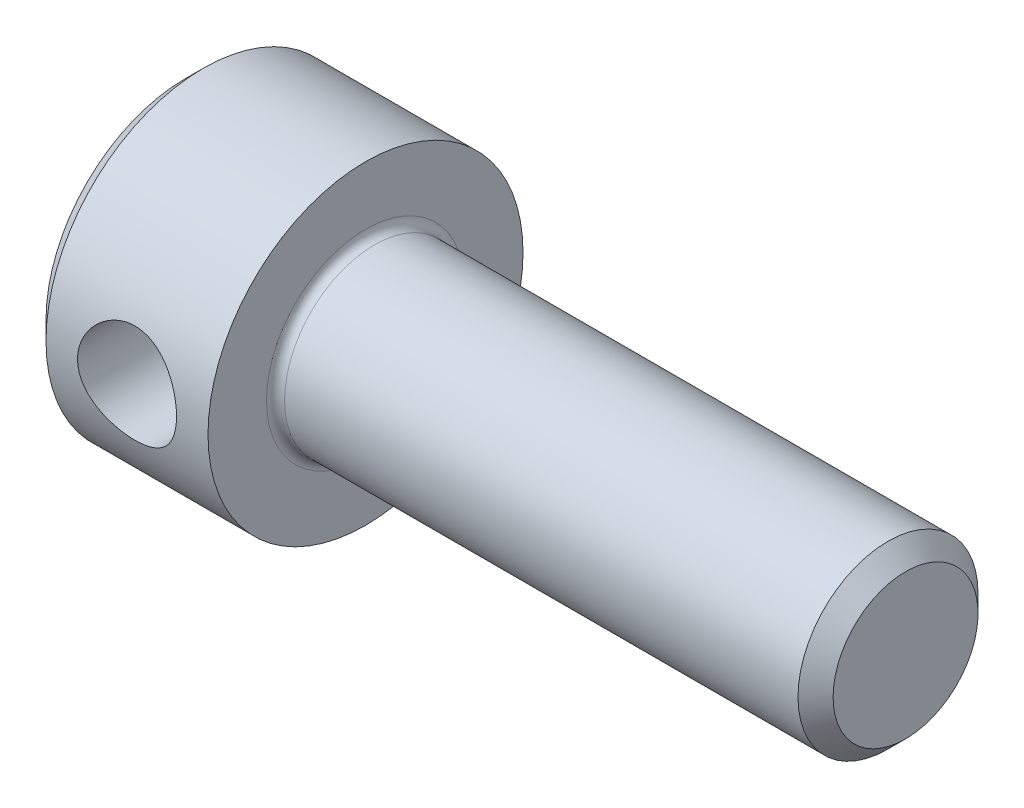
ISO-10303-21;
HEADER;
FILE_DESCRIPTION(('STEP AP214'),'2;1');
FILE_NAME('part.step','',(''),(''),'','','');
FILE_SCHEMA(('AUTOMOTIVE_DESIGN { 1 0 10303 214 1 1 1 1 }'));
ENDSEC;
DATA;
#1=APPLICATION_CONTEXT('core data for automotive mechanical design processes');
#2=APPLICATION_PROTOCOL_DEFINITION('international standard','automotive_design',2000,#1);
#3=PRODUCT_CONTEXT('',#1,'mechanical');
#4=PRODUCT('Part','Part','',(#3));
#5=PRODUCT_RELATED_PRODUCT_CATEGORY('part','',(#4));
#6=PRODUCT_DEFINITION_FORMATION('','',#4);
#7=PRODUCT_DEFINITION_CONTEXT('part definition',#1,'design');
#8=PRODUCT_DEFINITION('design','',#6,#7);
#9=PRODUCT_DEFINITION_SHAPE('','',#8);
#10=(LENGTH_UNIT() NAMED_UNIT(*) SI_UNIT(.MILLI.,.METRE.));
#11=(NAMED_UNIT(*) PLANE_ANGLE_UNIT() SI_UNIT($,.RADIAN.));
#12=(NAMED_UNIT(*) SI_UNIT($,.STERADIAN.) SOLID_ANGLE_UNIT());
#13=UNCERTAINTY_MEASURE_WITH_UNIT(LENGTH_MEASURE(1.E-05),#10,'distance_accuracy_value','');
#14=(GEOMETRIC_REPRESENTATION_CONTEXT(3) GLOBAL_UNCERTAINTY_ASSIGNED_CONTEXT((#13)) GLOBAL_UNIT_ASSIGNED_CONTEXT((#10,
#11,#12)) REPRESENTATION_CONTEXT('',''));
#15=CARTESIAN_POINT('',(0.,0.,0.));
#16=DIRECTION('',(0.,0.,1.));
#17=DIRECTION('',(1.,0.,0.));
#18=AXIS2_PLACEMENT_3D('',#15,#16,#17);
#19=CARTESIAN_POINT('',(-41.2573877243181,3.85092059838894,0.));
#20=DIRECTION('',(-1.,0.,0.));
#21=DIRECTION('',(0.,0.,1.));
#22=AXIS2_PLACEMENT_3D('',#19,#20,#21);
#23=CONICAL_SURFACE('',#22,1.5355,1.04719755119659);
#24=CARTESIAN_POINT('',(-41.2573877243181,3.85092059838894,0.));
#25=DIRECTION('',(-1.,0.,0.));
#26=DIRECTION('',(0.,0.,1.));
#27=AXIS2_PLACEMENT_3D('',#24,#25,#26);
#28=CIRCLE('',#27,1.5355);
#29=CARTESIAN_POINT('',(-41.2573877243181,2.52113859087794,0.767749999999976));
#30=VERTEX_POINT('',#29);
#31=CARTESIAN_POINT('',(-41.2573877243181,2.76925521574975,1.08984414023288));
#32=VERTEX_POINT('',#31);
#33=EDGE_CURVE('E162',#30,#32,#28,.T.);
#34=ORIENTED_EDGE('',*,*,#33,.T.);
#35=CARTESIAN_POINT('',(-41.3462398581514,2.78952319647957,1.31434233968245));
#36=CARTESIAN_POINT('',(-41.3296579013638,2.78500952857554,1.27377310679375));
#37=CARTESIAN_POINT('',(-41.3132698789426,2.78096848502642,1.23307458104));
#38=CARTESIAN_POINT('',(-41.281007371459,2.77376348555513,1.15139288716808));
#39=CARTESIAN_POINT('',(-41.265132935054,2.77059961252299,1.1104096925244));
#40=CARTESIAN_POINT('',(-41.2183409265454,2.76229915882602,0.986655695757561));
#41=CARTESIAN_POINT('',(-41.188397884933,2.75839101181697,0.903425163963204));
#42=CARTESIAN_POINT('',(-41.1330773304311,2.75318184444412,0.736539372571515));
#43=CARTESIAN_POINT('',(-41.1076465760028,2.75184828535579,0.652902990600578));
#44=CARTESIAN_POINT('',(-41.0634486065729,2.75071392124133,0.483935928030153));
#45=CARTESIAN_POINT('',(-41.0446701055224,2.75091050706179,0.398608378934132));
#46=CARTESIAN_POINT('',(-41.0205401880545,2.75148710934849,0.247656785120565));
#47=CARTESIAN_POINT('',(-41.0130140083932,2.75180955791364,0.182393152964781));
#48=CARTESIAN_POINT('',(-41.004817430063,2.7521686186372,0.0514477776131256));
#49=CARTESIAN_POINT('',(-41.0041430009028,2.7522053988349,-0.0142336970320513));
#50=CARTESIAN_POINT('',(-41.0097649572203,2.75194934321751,-0.145338797476179));
#51=CARTESIAN_POINT('',(-41.0160676906348,2.75165620723522,-0.210762134028722));
#52=CARTESIAN_POINT('',(-41.0346204106051,2.75111864096559,-0.340780601849683));
#53=CARTESIAN_POINT('',(-41.0468759370648,2.75087425634765,-0.405374903996106));
#54=CARTESIAN_POINT('',(-41.0777998334165,2.7509885100608,-0.542124262995785));
#55=CARTESIAN_POINT('',(-41.0971082022216,2.75143249953147,-0.614130299356506));
#56=CARTESIAN_POINT('',(-41.1396123725768,2.75379098210048,-0.756940889386141));
#57=CARTESIAN_POINT('',(-41.1628086325118,2.75570564868811,-0.827745300297328));
#58=CARTESIAN_POINT('',(-41.211768695407,2.76152963754729,-0.968373032486061));
#59=CARTESIAN_POINT('',(-41.2375326452337,2.76543907396831,-1.03819629738315));
#60=CARTESIAN_POINT('',(-41.2907873661122,2.77561965734353,-1.17691119919907));
#61=CARTESIAN_POINT('',(-41.3182760079251,2.7818879381685,-1.24580386203931));
#62=CARTESIAN_POINT('',(-41.3462398581525,2.78952319647878,-1.31434233968435));
#63=B_SPLINE_CURVE_WITH_KNOTS('',3,(#35,#36,#37,#38,#39,#40,#41,#42,#43,#44,#45,#46,#47,#48,#49,
#50,#51,#52,#53,#54,#55,#56,#57,#58,#59,#60,#61,#62),.UNSPECIFIED.,.F.,.F.,(4,2,2,2,2,2,2,2,2,2,
2,2,2,4),(0.,0.132169173373498,0.264350832089951,0.529838348402077,0.791947973616807,
1.05361075604424,1.25039394139162,1.44706136379172,1.64390786460278,1.84093791054354,
2.06441651424291,2.28792148477808,2.51143924668136,2.73468629421367),.UNSPECIFIED.);
#64=CARTESIAN_POINT('',(-41.2573877243181,2.76925521574975,-1.08984414023293));
#65=VERTEX_POINT('',#64);
#66=EDGE_CURVE('E11',#32,#65,#63,.T.);
#67=ORIENTED_EDGE('',*,*,#66,.T.);
#68=CARTESIAN_POINT('',(-41.2573877243181,2.52113859087793,-0.767750000000027));
#69=VERTEX_POINT('',#68);
#70=EDGE_CURVE('E152',#65,#69,#28,.T.);
#71=ORIENTED_EDGE('',*,*,#70,.T.);
#72=EDGE_CURVE('E154',#69,#30,#28,.T.);
#73=ORIENTED_EDGE('',*,*,#72,.T.);
#74=EDGE_LOOP('',(#34,#67,#71,#73));
#75=FACE_BOUND('',#74,.T.);
#76=ADVANCED_FACE('F39',(#75),#23,.F.);
#77=CARTESIAN_POINT('',(-43.2573877243181,3.85092059838894,0.));
#78=DIRECTION('',(-1.,0.,0.));
#79=DIRECTION('',(0.,0.,1.));
#80=AXIS2_PLACEMENT_3D('',#77,#78,#79);
#81=PLANE('',#80);
#82=DIRECTION('',(0.,-0.499999999999999,0.866025403784439));
#83=VECTOR('',#82,1.);
#84=CARTESIAN_POINT('',(-43.2573877243181,5.62396327507028,0.));
#85=LINE('',#84,#83);
#86=CARTESIAN_POINT('',(-43.2573877243181,5.62396327507028,0.));
#87=VERTEX_POINT('',#86);
#88=CARTESIAN_POINT('',(-43.2573877243181,4.73744193672961,1.53549999999997));
#89=VERTEX_POINT('',#88);
#90=EDGE_CURVE('E259',#87,#89,#85,.T.);
#91=ORIENTED_EDGE('',*,*,#90,.T.);
#92=DIRECTION('',(0.,1.,0.));
#93=VECTOR('',#92,1.);
#94=CARTESIAN_POINT('',(-43.2573877243181,2.96439926004827,1.53549999999997));
#95=LINE('',#94,#93);
#96=CARTESIAN_POINT('',(-43.2573877243181,2.96439926004827,1.53549999999997));
#97=VERTEX_POINT('',#96);
#98=EDGE_CURVE('E282',#97,#89,#95,.T.);
#99=ORIENTED_EDGE('',*,*,#98,.F.);
#100=DIRECTION('',(0.,-0.500000000000001,-0.866025403784438));
#101=VECTOR('',#100,1.);
#102=CARTESIAN_POINT('',(-43.2573877243181,2.96439926004827,1.53549999999997));
#103=LINE('',#102,#101);
#104=CARTESIAN_POINT('',(-43.2573877243181,2.0778779217076,0.));
#105=VERTEX_POINT('',#104);
#106=EDGE_CURVE('E286',#97,#105,#103,.T.);
#107=ORIENTED_EDGE('',*,*,#106,.T.);
#108=DIRECTION('',(0.,0.499999999999999,-0.866025403784439));
#109=VECTOR('',#108,1.);
#110=CARTESIAN_POINT('',(-43.2573877243181,2.0778779217076,0.));
#111=LINE('',#110,#109);
#112=CARTESIAN_POINT('',(-43.2573877243181,2.96439926004827,-1.53550000000003));
#113=VERTEX_POINT('',#112);
#114=EDGE_CURVE('E290',#105,#113,#111,.T.);
#115=ORIENTED_EDGE('',*,*,#114,.T.);
#116=DIRECTION('',(0.,-1.,0.));
#117=VECTOR('',#116,1.);
#118=CARTESIAN_POINT('',(-43.2573877243181,4.73744193672961,-1.53550000000003));
#119=LINE('',#118,#117);
#120=CARTESIAN_POINT('',(-43.2573877243181,4.73744193672961,-1.53550000000003));
#121=VERTEX_POINT('',#120);
#122=EDGE_CURVE('E294',#121,#113,#119,.T.);
#123=ORIENTED_EDGE('',*,*,#122,.F.);
#124=DIRECTION('',(0.,-0.500000000000001,-0.866025403784438));
#125=VECTOR('',#124,1.);
#126=CARTESIAN_POINT('',(-43.2573877243181,5.62396327507028,0.));
#127=LINE('',#126,#125);
#128=EDGE_CURVE('E298',#87,#121,#127,.T.);
#129=ORIENTED_EDGE('',*,*,#128,.F.);
#130=EDGE_LOOP('',(#91,#99,#107,#115,#123,#129));
#131=FACE_BOUND('',#130,.T.);
#132=CARTESIAN_POINT('',(-43.2573877243181,3.85092059838894,0.));
#133=DIRECTION('',(-1.,0.,0.));
#134=DIRECTION('',(0.,0.,1.));
#135=AXIS2_PLACEMENT_3D('',#132,#133,#134);
#136=CIRCLE('',#135,3.1);
#137=CARTESIAN_POINT('',(-43.2573877243181,3.85092059838894,3.09999999999997));
#138=VERTEX_POINT('',#137);
#139=EDGE_CURVE('E172',#138,#138,#136,.T.);
#140=ORIENTED_EDGE('',*,*,#139,.T.);
#141=EDGE_LOOP('',(#140));
#142=FACE_BOUND('',#141,.T.);
#143=ADVANCED_FACE('F327',(#131,#142),#81,.T.);
#144=CARTESIAN_POINT('',(-27.2573877243181,5.46092059838894,0.));
#145=DIRECTION('',(1.,0.,0.));
#146=DIRECTION('',(0.,0.,-1.));
#147=AXIS2_PLACEMENT_3D('',#144,#145,#146);
#148=PLANE('',#147);
#149=CARTESIAN_POINT('',(-27.2573877243181,3.85092059838894,0.));
#150=DIRECTION('',(-1.,0.,0.));
#151=DIRECTION('',(0.,0.,1.));
#152=AXIS2_PLACEMENT_3D('',#149,#150,#151);
#153=CIRCLE('',#152,1.61);
#154=CARTESIAN_POINT('',(-27.2573877243181,3.85092059838894,1.60999999999997));
#155=VERTEX_POINT('',#154);
#156=EDGE_CURVE('E190',#155,#155,#153,.T.);
#157=ORIENTED_EDGE('',*,*,#156,.F.);
#158=EDGE_LOOP('',(#157));
#159=FACE_BOUND('',#158,.T.);
#160=ADVANCED_FACE('F373',(#159),#148,.T.);
#161=CARTESIAN_POINT('',(-27.2573877243181,3.85092059838894,0.));
#162=DIRECTION('',(-1.,0.,0.));
#163=DIRECTION('',(0.,0.,1.));
#164=AXIS2_PLACEMENT_3D('',#161,#162,#163);
#165=CONICAL_SURFACE('',#164,1.61,0.785398163397465);
#166=CARTESIAN_POINT('',(-27.6473877243181,3.85092059838894,0.));
#167=DIRECTION('',(-1.,0.,0.));
#168=DIRECTION('',(0.,0.,1.));
#169=AXIS2_PLACEMENT_3D('',#166,#167,#168);
#170=CIRCLE('',#169,2.);
#171=CARTESIAN_POINT('',(-27.6473877243181,3.85092059838894,1.99999999999997));
#172=VERTEX_POINT('',#171);
#173=EDGE_CURVE('E186',#172,#172,#170,.T.);
#174=ORIENTED_EDGE('',*,*,#173,.F.);
#175=EDGE_LOOP('',(#174));
#176=FACE_BOUND('',#175,.T.);
#177=ORIENTED_EDGE('',*,*,#156,.T.);
#178=EDGE_LOOP('',(#177));
#179=FACE_BOUND('',#178,.T.);
#180=ADVANCED_FACE('F516',(#176,#179),#165,.T.);
#181=CARTESIAN_POINT('',(-75.0073877243181,3.85092059838894,0.));
#182=DIRECTION('',(-1.,0.,0.));
#183=DIRECTION('',(0.,0.,1.));
#184=AXIS2_PLACEMENT_3D('',#181,#182,#183);
#185=CYLINDRICAL_SURFACE('',#184,2.);
#186=CARTESIAN_POINT('',(-39.0573877243181,3.85092059838894,0.));
#187=DIRECTION('',(1.,0.,0.));
#188=DIRECTION('',(0.,0.,-1.));
#189=AXIS2_PLACEMENT_3D('',#186,#187,#188);
#190=CIRCLE('',#189,2.);
#191=CARTESIAN_POINT('',(-39.0573877243181,3.85092059838894,-2.00000000000003));
#192=VERTEX_POINT('',#191);
#193=EDGE_CURVE('E141',#192,#192,#190,.T.);
#194=ORIENTED_EDGE('',*,*,#193,.T.);
#195=EDGE_LOOP('',(#194));
#196=FACE_BOUND('',#195,.T.);
#197=ORIENTED_EDGE('',*,*,#173,.T.);
#198=EDGE_LOOP('',(#197));
#199=FACE_BOUND('',#198,.T.);
#200=ADVANCED_FACE('F506',(#196,#199),#185,.T.);
#201=CARTESIAN_POINT('',(-39.2573877243181,7.35092059838894,0.));
#202=DIRECTION('',(1.,0.,0.));
#203=DIRECTION('',(0.,0.,-1.));
#204=AXIS2_PLACEMENT_3D('',#201,#202,#203);
#205=PLANE('',#204);
#206=CARTESIAN_POINT('',(-39.2573877243181,3.85092059838894,0.));
#207=DIRECTION('',(1.,0.,0.));
#208=DIRECTION('',(0.,0.,-1.));
#209=AXIS2_PLACEMENT_3D('',#206,#207,#208);
#210=CIRCLE('',#209,2.2);
#211=CARTESIAN_POINT('',(-39.2573877243181,3.85092059838894,-2.20000000000003));
#212=VERTEX_POINT('',#211);
#213=EDGE_CURVE('E194',#212,#212,#210,.F.);
#214=ORIENTED_EDGE('',*,*,#213,.T.);
#215=EDGE_LOOP('',(#214));
#216=FACE_BOUND('',#215,.T.);
#217=CARTESIAN_POINT('',(-39.2573877243181,3.85092059838894,0.));
#218=DIRECTION('',(-1.,0.,0.));
#219=DIRECTION('',(0.,0.,1.));
#220=AXIS2_PLACEMENT_3D('',#217,#218,#219);
#221=CIRCLE('',#220,3.5);
#222=CARTESIAN_POINT('',(-39.2573877243181,3.85092059838894,3.49999999999997));
#223=VERTEX_POINT('',#222);
#224=EDGE_CURVE('E180',#223,#223,#221,.T.);
#225=ORIENTED_EDGE('',*,*,#224,.F.);
#226=EDGE_LOOP('',(#225));
#227=FACE_BOUND('',#226,.T.);
#228=ADVANCED_FACE('F354',(#216,#227),#205,.T.);
#229=CARTESIAN_POINT('',(-75.0073877243181,3.85092059838894,0.));
#230=DIRECTION('',(-1.,0.,0.));
#231=DIRECTION('',(0.,0.,1.));
#232=AXIS2_PLACEMENT_3D('',#229,#230,#231);
#233=CYLINDRICAL_SURFACE('',#232,3.5);
#234=CARTESIAN_POINT('',(-42.1573877243181,3.85092059838894,3.49999999999997));
#235=CARTESIAN_POINT('',(-42.1573873834202,3.7907113876642,3.49999973456292));
#236=CARTESIAN_POINT('',(-42.1524280662825,3.73049853765594,3.49843172756569));
#237=CARTESIAN_POINT('',(-42.1327745488912,3.61183477953496,3.49233032576851));
#238=CARTESIAN_POINT('',(-42.1180782462503,3.55338425478965,3.48779629055332));
#239=CARTESIAN_POINT('',(-42.0794960625473,3.43997341094447,3.47625792267345));
#240=CARTESIAN_POINT('',(-42.0556245018895,3.38500780767441,3.46925744095951));
#241=CARTESIAN_POINT('',(-41.9994306741368,3.27985962854935,3.45350829402334));
#242=CARTESIAN_POINT('',(-41.9671070460959,3.22967782475577,3.44475934731799));
#243=CARTESIAN_POINT('',(-41.8938652124089,3.13395580596247,3.42613597073028));
#244=CARTESIAN_POINT('',(-41.8527309080997,3.08858576928919,3.41623681235958));
#245=CARTESIAN_POINT('',(-41.7634954340771,3.00526126871357,3.39657133016693));
#246=CARTESIAN_POINT('',(-41.7153929514484,2.96730820545954,3.38680503175809));
#247=CARTESIAN_POINT('',(-41.6121084379567,2.89896821064451,3.3682451448506));
#248=CARTESIAN_POINT('',(-41.5567792663941,2.86879459073307,3.35948204561582));
#249=CARTESIAN_POINT('',(-41.4415119290006,2.81825134928494,3.34429301600354));
#250=CARTESIAN_POINT('',(-41.3815749980662,2.79787911149175,3.33786646205032));
#251=CARTESIAN_POINT('',(-41.260715167108,2.76814094576714,3.32833696577379));
#252=CARTESIAN_POINT('',(-41.1998777223758,2.75845906232563,3.32513886750158));
#253=CARTESIAN_POINT('',(-41.0773643651739,2.74938929207552,3.32214594710213));
#254=CARTESIAN_POINT('',(-41.0156886830221,2.74999863254013,3.32235020828944));
#255=CARTESIAN_POINT('',(-40.8958698033576,2.76124704438128,3.32605498490235));
#256=CARTESIAN_POINT('',(-40.8376840369248,2.77148359708358,3.32942320682572));
#257=CARTESIAN_POINT('',(-40.7239016799105,2.80104289283168,3.33886134671267));
#258=CARTESIAN_POINT('',(-40.6683053680847,2.82036661164014,3.34493155480666));
#259=CARTESIAN_POINT('',(-40.5603249314161,2.86783421338511,3.35919049680107));
#260=CARTESIAN_POINT('',(-40.5080002226517,2.89610388869483,3.36740913458015));
#261=CARTESIAN_POINT('',(-40.4087056137049,2.96057357411882,3.38502530004871));
#262=CARTESIAN_POINT('',(-40.3617371228012,2.99677566405095,3.39442313663833));
#263=CARTESIAN_POINT('',(-40.272213733094,3.07805420717286,3.41386867188401));
#264=CARTESIAN_POINT('',(-40.2299618953433,3.1234626899397,3.4239263623352));
#265=CARTESIAN_POINT('',(-40.1535987138429,3.22084575228516,3.4431767255751));
#266=CARTESIAN_POINT('',(-40.119487987074,3.27282082906217,3.45236933277083));
#267=CARTESIAN_POINT('',(-40.0601667913599,3.38245063239259,3.46895221116934));
#268=CARTESIAN_POINT('',(-40.035029347989,3.44014728509164,3.47632754956119));
#269=CARTESIAN_POINT('',(-39.9949072531769,3.55923609668292,3.48833705276153));
#270=CARTESIAN_POINT('',(-39.9799194820884,3.62062711373644,3.49297205979449));
#271=CARTESIAN_POINT('',(-39.9610401500311,3.74279010050805,3.49884280153291));
#272=CARTESIAN_POINT('',(-39.9567383831766,3.80349273225309,3.50020413454195));
#273=CARTESIAN_POINT('',(-39.9581956027201,3.92475943114988,3.49974604109031));
#274=CARTESIAN_POINT('',(-39.9639531007111,3.98532351747369,3.49792708519718));
#275=CARTESIAN_POINT('',(-39.9850364767302,4.10300674227625,3.49139536096763));
#276=CARTESIAN_POINT('',(-40.0001176279061,4.16017423072868,3.48675665589575));
#277=CARTESIAN_POINT('',(-40.039120983363,4.2711509186201,3.47512909180738));
#278=CARTESIAN_POINT('',(-40.0630442832297,4.32495970093276,3.46813994156885));
#279=CARTESIAN_POINT('',(-40.1197090557466,4.42916124009439,3.45231590268172));
#280=CARTESIAN_POINT('',(-40.1526526144083,4.47943768816588,3.44343990989631));
#281=CARTESIAN_POINT('',(-40.2261807365925,4.57388604075995,3.42485645584634));
#282=CARTESIAN_POINT('',(-40.2667673949573,4.61805626590261,3.41514876702674));
#283=CARTESIAN_POINT('',(-40.3563591060064,4.70087772023817,3.39550567407635));
#284=CARTESIAN_POINT('',(-40.4056365168376,4.73923653379896,3.38557675334802));
#285=CARTESIAN_POINT('',(-40.5101444773511,4.80716756465107,3.36702183550397));
#286=CARTESIAN_POINT('',(-40.565374942689,4.83673990640902,3.35839581993252));
#287=CARTESIAN_POINT('',(-40.6801172495615,4.88607795707992,3.34351833127723));
#288=CARTESIAN_POINT('',(-40.7396120990845,4.90588035178951,3.33725799621246));
#289=CARTESIAN_POINT('',(-40.8613292887847,4.93511361199758,3.32787707074694));
#290=CARTESIAN_POINT('',(-40.9235505660054,4.9445484827374,3.32475526789011));
#291=CARTESIAN_POINT('',(-41.045894648902,4.95248911261763,3.3221321933535));
#292=CARTESIAN_POINT('',(-41.1059832615456,4.95147503305109,3.32247184889897));
#293=CARTESIAN_POINT('',(-41.2250888369603,4.93970756225374,3.32634641168541));
#294=CARTESIAN_POINT('',(-41.2841058506654,4.92895463515972,3.32988116665339));
#295=CARTESIAN_POINT('',(-41.3985235128848,4.89833773140128,3.3396358699192));
#296=CARTESIAN_POINT('',(-41.4539650923446,4.87861265753111,3.34581479895335));
#297=CARTESIAN_POINT('',(-41.5607959376261,4.83072099355375,3.36015075770839));
#298=CARTESIAN_POINT('',(-41.6121843696648,4.80255267225643,3.36830819303357));
#299=CARTESIAN_POINT('',(-41.7116482094039,4.73727279051963,3.38608410385312));
#300=CARTESIAN_POINT('',(-41.759512512122,4.69985186552403,3.39574756963085));
#301=CARTESIAN_POINT('',(-41.848437690686,4.61767158782881,3.41524140733472));
#302=CARTESIAN_POINT('',(-41.8894967324757,4.57291026329539,3.4250718234705));
#303=CARTESIAN_POINT('',(-41.96500977999,4.47553398739591,3.44418305442764));
#304=CARTESIAN_POINT('',(-41.9991995788118,4.4227078098326,3.45343483045124));
#305=CARTESIAN_POINT('',(-42.0581687700261,4.31176731364411,3.46997958589275));
#306=CARTESIAN_POINT('',(-42.0829517571438,4.25365502560186,3.47727331324811));
#307=CARTESIAN_POINT('',(-42.120666311583,4.13866612542392,3.48859067602488));
#308=CARTESIAN_POINT('',(-42.1343968145898,4.08207234209083,3.49283175363292));
#309=CARTESIAN_POINT('',(-42.1527567396148,3.96729348273144,3.49853625514412));
#310=CARTESIAN_POINT('',(-42.1573880537729,3.90910874009084,3.50000025652698));
#311=CARTESIAN_POINT('',(-42.1573877243181,3.85092059838894,3.49999999999997));
#312=B_SPLINE_CURVE_WITH_KNOTS('',3,(#234,#235,#236,#237,#238,#239,#240,#241,#242,#243,#244,
#245,#246,#247,#248,#249,#250,#251,#252,#253,#254,#255,#256,#257,#258,#259,#260,#261,#262,#263,
#264,#265,#266,#267,#268,#269,#270,#271,#272,#273,#274,#275,#276,#277,#278,#279,#280,#281,#282,
#283,#284,#285,#286,#287,#288,#289,#290,#291,#292,#293,#294,#295,#296,#297,#298,#299,#300,#301,
#302,#303,#304,#305,#306,#307,#308,#309,#310,#311),.UNSPECIFIED.,.T.,.F.,(4,2,2,2,2,2,2,2,2,2,2,
2,2,2,2,2,2,2,2,2,2,2,2,2,2,2,2,2,2,2,2,2,2,2,2,2,2,2,4),(0.,0.180413730714977,
0.360866428643541,0.541038618881322,0.721239838205205,0.90650774532269,1.09181060537013,
1.28175460544297,1.4716478761077,1.65576467995627,1.83983187867959,2.01652991522281,
2.19324692959978,2.37256835806168,2.55193685959763,2.73956966477803,2.92721668534894,
3.11635773808695,3.30544062919201,3.48714452387749,3.66882153524391,3.84592125463877,
4.02304292492058,4.20451336095802,4.38603360750435,4.57483437298674,4.76363246384467,
4.95171612432258,5.13972709766804,5.31913839547514,5.49854114329734,5.67525631794223,
5.85200775080216,6.03574234483052,6.21952637613247,6.40940539470643,6.59921177956026,
6.77360575169964,6.94796345547033),.UNSPECIFIED.);
#313=CARTESIAN_POINT('',(-42.1573877243181,3.85092059838894,3.49999999999997));
#314=VERTEX_POINT('',#313);
#315=EDGE_CURVE('E224',#314,#314,#312,.T.);
#316=ORIENTED_EDGE('',*,*,#315,.F.);
#317=EDGE_LOOP('',(#316));
#318=FACE_BOUND('',#317,.T.);
#319=CARTESIAN_POINT('',(-39.9573877243181,3.85092059838894,-3.50000000000003));
#320=CARTESIAN_POINT('',(-39.957388065216,3.91112980911368,-3.49999973456298));
#321=CARTESIAN_POINT('',(-39.9623473823537,3.97134265912194,-3.49843172756575));
#322=CARTESIAN_POINT('',(-39.982000899745,4.09000641724292,-3.49233032576857));
#323=CARTESIAN_POINT('',(-39.9966972023858,4.14845694198824,-3.48779629055338));
#324=CARTESIAN_POINT('',(-40.0352793860889,4.26186778583341,-3.4762579226735));
#325=CARTESIAN_POINT('',(-40.0591509467467,4.31683338910348,-3.46925744095957));
#326=CARTESIAN_POINT('',(-40.1153447744994,4.42198156822854,-3.45350829402339));
#327=CARTESIAN_POINT('',(-40.1476684025402,4.47216337202212,-3.44475934731805));
#328=CARTESIAN_POINT('',(-40.2209102362272,4.56788539081542,-3.42613597073033));
#329=CARTESIAN_POINT('',(-40.2620445405365,4.6132554274887,-3.41623681235963));
#330=CARTESIAN_POINT('',(-40.351280014559,4.69657992806432,-3.39657133016698));
#331=CARTESIAN_POINT('',(-40.3993824971878,4.73453299131835,-3.38680503175814));
#332=CARTESIAN_POINT('',(-40.5026670106794,4.80287298613337,-3.36824514485065));
#333=CARTESIAN_POINT('',(-40.557996182242,4.83304660604482,-3.35948204561588));
#334=CARTESIAN_POINT('',(-40.6732635196356,4.88358984749295,-3.3442930160036));
#335=CARTESIAN_POINT('',(-40.73320045057,4.90396208528613,-3.33786646205038));
#336=CARTESIAN_POINT('',(-40.8540602815281,4.93370025101074,-3.32833696577384));
#337=CARTESIAN_POINT('',(-40.9148977262604,4.94338213445226,-3.32513886750163));
#338=CARTESIAN_POINT('',(-41.0374110834623,4.95245190470236,-3.32214594710219));
#339=CARTESIAN_POINT('',(-41.099086765614,4.95184256423775,-3.32235020828949));
#340=CARTESIAN_POINT('',(-41.2189056452785,4.94059415239661,-3.3260549849024));
#341=CARTESIAN_POINT('',(-41.2770914117114,4.93035759969431,-3.32942320682577));
#342=CARTESIAN_POINT('',(-41.3908737687256,4.9007983039462,-3.33886134671273));
#343=CARTESIAN_POINT('',(-41.4464700805515,4.88147458513774,-3.34493155480672));
#344=CARTESIAN_POINT('',(-41.5544505172201,4.83400698339277,-3.35919049680112));
#345=CARTESIAN_POINT('',(-41.6067752259845,4.80573730808306,-3.3674091345802));
#346=CARTESIAN_POINT('',(-41.7060698349313,4.74126762265907,-3.38502530004876));
#347=CARTESIAN_POINT('',(-41.7530383258349,4.70506553272693,-3.39442313663838));
#348=CARTESIAN_POINT('',(-41.8425617155422,4.62378698960503,-3.41386867188406));
#349=CARTESIAN_POINT('',(-41.8848135532929,4.57837850683819,-3.42392636233525));
#350=CARTESIAN_POINT('',(-41.9611767347932,4.48099544449272,-3.44317672557515));
#351=CARTESIAN_POINT('',(-41.9952874615622,4.42902036771571,-3.45236933277088));
#352=CARTESIAN_POINT('',(-42.0546086572763,4.31939056438529,-3.46895221116939));
#353=CARTESIAN_POINT('',(-42.0797461006472,4.26169391168624,-3.47632754956125));
#354=CARTESIAN_POINT('',(-42.1198681954592,4.14260510009496,-3.48833705276158));
#355=CARTESIAN_POINT('',(-42.1348559665478,4.08121408304144,-3.49297205979455));
#356=CARTESIAN_POINT('',(-42.1537352986051,3.95905109626983,-3.49884280153296));
#357=CARTESIAN_POINT('',(-42.1580370654596,3.8983484645248,-3.50020413454201));
#358=CARTESIAN_POINT('',(-42.1565798459161,3.77708176562801,-3.49974604109036));
#359=CARTESIAN_POINT('',(-42.150822347925,3.7165176793042,-3.49792708519723));
#360=CARTESIAN_POINT('',(-42.129738971906,3.59883445450163,-3.49139536096768));
#361=CARTESIAN_POINT('',(-42.1146578207301,3.54166696604921,-3.4867566558958));
#362=CARTESIAN_POINT('',(-42.0756544652732,3.43069027815778,-3.47512909180744));
#363=CARTESIAN_POINT('',(-42.0517311654065,3.37688149584512,-3.4681399415689));
#364=CARTESIAN_POINT('',(-41.9950663928895,3.2726799566835,-3.45231590268177));
#365=CARTESIAN_POINT('',(-41.9621228342279,3.222403508612,-3.44343990989636));
#366=CARTESIAN_POINT('',(-41.8885947120436,3.12795515601793,-3.4248564558464));
#367=CARTESIAN_POINT('',(-41.8480080536788,3.08378493087527,-3.41514876702679));
#368=CARTESIAN_POINT('',(-41.7584163426298,3.00096347653971,-3.3955056740764));
#369=CARTESIAN_POINT('',(-41.7091389317985,2.96260466297893,-3.38557675334807));
#370=CARTESIAN_POINT('',(-41.6046309712851,2.89467363212681,-3.36702183550402));
#371=CARTESIAN_POINT('',(-41.5494005059472,2.86510129036887,-3.35839581993257));
#372=CARTESIAN_POINT('',(-41.4346581990746,2.81576323969797,-3.34351833127729));
#373=CARTESIAN_POINT('',(-41.3751633495516,2.79596084498837,-3.33725799621251));
#374=CARTESIAN_POINT('',(-41.2534461598515,2.7667275847803,-3.32787707074699));
#375=CARTESIAN_POINT('',(-41.1912248826307,2.75729271404049,-3.32475526789016));
#376=CARTESIAN_POINT('',(-41.0688807997342,2.74935208416025,-3.32213219335356));
#377=CARTESIAN_POINT('',(-41.0087921870906,2.7503661637268,-3.32247184889903));
#378=CARTESIAN_POINT('',(-40.8896866116758,2.76213363452414,-3.32634641168546));
#379=CARTESIAN_POINT('',(-40.8306695979708,2.77288656161817,-3.32988116665345));
#380=CARTESIAN_POINT('',(-40.7162519357514,2.8035034653766,-3.33963586991925));
#381=CARTESIAN_POINT('',(-40.6608103562916,2.82322853924677,-3.3458147989534));
#382=CARTESIAN_POINT('',(-40.5539795110101,2.87112020322413,-3.36015075770844));
#383=CARTESIAN_POINT('',(-40.5025910789714,2.89928852452146,-3.36830819303362));
#384=CARTESIAN_POINT('',(-40.4031272392322,2.96456840625826,-3.38608410385318));
#385=CARTESIAN_POINT('',(-40.3552629365141,3.00198933125386,-3.39574756963091));
#386=CARTESIAN_POINT('',(-40.2663377579501,3.08416960894908,-3.41524140733477));
#387=CARTESIAN_POINT('',(-40.2252787161605,3.1289309334825,-3.42507182347056));
#388=CARTESIAN_POINT('',(-40.1497656686461,3.22630720938198,-3.44418305442769));
#389=CARTESIAN_POINT('',(-40.1155758698244,3.27913338694528,-3.45343483045129));
#390=CARTESIAN_POINT('',(-40.0566066786101,3.39007388313378,-3.4699795858928));
#391=CARTESIAN_POINT('',(-40.0318236914924,3.44818617117603,-3.47727331324817));
#392=CARTESIAN_POINT('',(-39.9941091370531,3.56317507135397,-3.48859067602494));
#393=CARTESIAN_POINT('',(-39.9803786340463,3.61976885468706,-3.49283175363297));
#394=CARTESIAN_POINT('',(-39.9620187090214,3.73454771404645,-3.49853625514417));
#395=CARTESIAN_POINT('',(-39.9573873948633,3.79273245668704,-3.50000025652703));
#396=CARTESIAN_POINT('',(-39.9573877243181,3.85092059838894,-3.50000000000003));
#397=B_SPLINE_CURVE_WITH_KNOTS('',3,(#319,#320,#321,#322,#323,#324,#325,#326,#327,#328,#329,
#330,#331,#332,#333,#334,#335,#336,#337,#338,#339,#340,#341,#342,#343,#344,#345,#346,#347,#348,
#349,#350,#351,#352,#353,#354,#355,#356,#357,#358,#359,#360,#361,#362,#363,#364,#365,#366,#367,
#368,#369,#370,#371,#372,#373,#374,#375,#376,#377,#378,#379,#380,#381,#382,#383,#384,#385,#386,
#387,#388,#389,#390,#391,#392,#393,#394,#395,#396),.UNSPECIFIED.,.T.,.F.,(4,2,2,2,2,2,2,2,2,2,2,
2,2,2,2,2,2,2,2,2,2,2,2,2,2,2,2,2,2,2,2,2,2,2,2,2,2,2,4),(0.,0.180413730714976,
0.360866428643541,0.541038618881319,0.721239838205205,0.906507745322692,1.09181060537013,
1.28175460544297,1.4716478761077,1.65576467995627,1.83983187867959,2.01652991522281,
2.19324692959978,2.3725683580617,2.55193685959763,2.73956966477803,2.92721668534894,
3.11635773808696,3.30544062919201,3.48714452387749,3.66882153524392,3.84592125463877,
4.02304292492058,4.20451336095803,4.38603360750435,4.57483437298674,4.76363246384468,
4.95171612432259,5.13972709766804,5.31913839547514,5.49854114329733,5.67525631794222,
5.85200775080216,6.03574234483052,6.21952637613247,6.40940539470644,6.59921177956026,
6.77360575169964,6.94796345547033),.UNSPECIFIED.);
#398=CARTESIAN_POINT('',(-39.9573877243181,3.85092059838894,-3.50000000000003));
#399=VERTEX_POINT('',#398);
#400=EDGE_CURVE('E145',#399,#399,#397,.T.);
#401=ORIENTED_EDGE('',*,*,#400,.T.);
#402=EDGE_LOOP('',(#401));
#403=FACE_BOUND('',#402,.T.);
#404=ORIENTED_EDGE('',*,*,#224,.T.);
#405=EDGE_LOOP('',(#404));
#406=FACE_BOUND('',#405,.T.);
#407=CARTESIAN_POINT('',(-42.8573877243181,3.85092059838894,0.));
#408=DIRECTION('',(-1.,0.,0.));
#409=DIRECTION('',(0.,0.,1.));
#410=AXIS2_PLACEMENT_3D('',#407,#408,#409);
#411=CIRCLE('',#410,3.5);
#412=CARTESIAN_POINT('',(-42.8573877243181,3.85092059838894,3.49999999999997));
#413=VERTEX_POINT('',#412);
#414=EDGE_CURVE('E175',#413,#413,#411,.T.);
#415=ORIENTED_EDGE('',*,*,#414,.F.);
#416=EDGE_LOOP('',(#415));
#417=FACE_BOUND('',#416,.T.);
#418=ADVANCED_FACE('F350',(#318,#403,#406,#417),#233,.T.);
#419=CARTESIAN_POINT('',(-43.2573877243181,3.85092059838894,0.));
#420=DIRECTION('',(1.,0.,0.));
#421=DIRECTION('',(0.,0.,-1.));
#422=AXIS2_PLACEMENT_3D('',#419,#420,#421);
#423=CONICAL_SURFACE('',#422,3.1,0.785398163397455);
#424=ORIENTED_EDGE('',*,*,#414,.T.);
#425=EDGE_LOOP('',(#424));
#426=FACE_BOUND('',#425,.T.);
#427=ORIENTED_EDGE('',*,*,#139,.F.);
#428=EDGE_LOOP('',(#427));
#429=FACE_BOUND('',#428,.T.);
#430=ADVANCED_FACE('F353',(#426,#429),#423,.T.);
#431=CARTESIAN_POINT('',(-39.0573877243181,3.85092059838894,0.));
#432=DIRECTION('',(1.,0.,0.));
#433=DIRECTION('',(0.,0.,-1.));
#434=AXIS2_PLACEMENT_3D('',#431,#432,#433);
#435=TOROIDAL_SURFACE('',#434,2.2,0.2);
#436=ORIENTED_EDGE('',*,*,#193,.F.);
#437=EDGE_LOOP('',(#436));
#438=FACE_BOUND('',#437,.T.);
#439=ORIENTED_EDGE('',*,*,#213,.F.);
#440=EDGE_LOOP('',(#439));
#441=FACE_BOUND('',#440,.T.);
#442=ADVANCED_FACE('F41',(#438,#441),#435,.F.);
#443=CARTESIAN_POINT('',(-41.2573877243181,5.62396327507028,0.));
#444=DIRECTION('',(0.,-0.866025403784439,-0.499999999999999));
#445=DIRECTION('',(0.,0.499999999999999,-0.866025403784439));
#446=AXIS2_PLACEMENT_3D('',#443,#444,#445);
#447=PLANE('',#446);
#448=CARTESIAN_POINT('',(-41.0573877243181,3.85092059838894,3.07099999999997));
#449=DIRECTION('',(0.,-0.866025403784439,-0.499999999999999));
#450=DIRECTION('',(0.,-0.499999999999999,0.866025403784439));
#451=AXIS2_PLACEMENT_3D('',#448,#449,#450);
#452=ELLIPSE('',#451,2.2,1.1);
#453=CARTESIAN_POINT('',(-41.7086019107934,4.73744193672961,1.53549999999997));
#454=VERTEX_POINT('',#453);
#455=CARTESIAN_POINT('',(-41.2573877243181,4.93258598102814,1.19750060048045));
#456=VERTEX_POINT('',#455);
#457=EDGE_CURVE('E241',#454,#456,#452,.T.);
#458=ORIENTED_EDGE('',*,*,#457,.F.);
#459=DIRECTION('',(-1.,0.,0.));
#460=VECTOR('',#459,1.);
#461=CARTESIAN_POINT('',(-41.2573877243181,4.73744193672961,1.53549999999997));
#462=LINE('',#461,#460);
#463=EDGE_CURVE('E167',#454,#89,#462,.T.);
#464=ORIENTED_EDGE('',*,*,#463,.T.);
#465=ORIENTED_EDGE('',*,*,#90,.F.);
#466=DIRECTION('',(-1.,0.,0.));
#467=VECTOR('',#466,1.);
#468=CARTESIAN_POINT('',(-41.2573877243181,5.62396327507028,0.));
#469=LINE('',#468,#467);
#470=CARTESIAN_POINT('',(-41.2573877243181,5.62396327507028,0.));
#471=VERTEX_POINT('',#470);
#472=EDGE_CURVE('E278',#471,#87,#469,.T.);
#473=ORIENTED_EDGE('',*,*,#472,.F.);
#474=DIRECTION('',(0.,-0.499999999999999,0.866025403784439));
#475=VECTOR('',#474,1.);
#476=CARTESIAN_POINT('',(-41.2573877243181,5.62396327507028,0.));
#477=LINE('',#476,#475);
#478=CARTESIAN_POINT('',(-41.2573877243181,5.18070260589995,0.76774999999997));
#479=VERTEX_POINT('',#478);
#480=EDGE_CURVE('E260',#471,#479,#477,.T.);
#481=ORIENTED_EDGE('',*,*,#480,.T.);
#482=EDGE_CURVE('E265',#479,#456,#477,.T.);
#483=ORIENTED_EDGE('',*,*,#482,.T.);
#484=EDGE_LOOP('',(#458,#464,#465,#473,#481,#483));
#485=FACE_BOUND('',#484,.T.);
#486=ADVANCED_FACE('F332',(#485),#447,.T.);
#487=CARTESIAN_POINT('',(-41.2573877243181,2.96439926004827,1.53549999999997));
#488=DIRECTION('',(0.,0.,1.));
#489=DIRECTION('',(0.,-1.,0.));
#490=AXIS2_PLACEMENT_3D('',#487,#488,#489);
#491=PLANE('',#490);
#492=ORIENTED_EDGE('',*,*,#463,.F.);
#493=CARTESIAN_POINT('',(-41.0573877243181,3.85092059838894,1.53549999999997));
#494=DIRECTION('',(0.,0.,1.));
#495=DIRECTION('',(0.,-1.,0.));
#496=AXIS2_PLACEMENT_3D('',#493,#494,#495);
#497=CIRCLE('',#496,1.1);
#498=CARTESIAN_POINT('',(-41.7086019107934,2.96439926004827,1.53549999999997));
#499=VERTEX_POINT('',#498);
#500=EDGE_CURVE('E248',#454,#499,#497,.T.);
#501=ORIENTED_EDGE('',*,*,#500,.T.);
#502=DIRECTION('',(-1.,0.,0.));
#503=VECTOR('',#502,1.);
#504=CARTESIAN_POINT('',(-41.2573877243181,2.96439926004827,1.53549999999997));
#505=LINE('',#504,#503);
#506=EDGE_CURVE('E170',#499,#97,#505,.T.);
#507=ORIENTED_EDGE('',*,*,#506,.T.);
#508=ORIENTED_EDGE('',*,*,#98,.T.);
#509=EDGE_LOOP('',(#492,#501,#507,#508));
#510=FACE_BOUND('',#509,.T.);
#511=ADVANCED_FACE('F320',(#510),#491,.F.);
#512=CARTESIAN_POINT('',(-41.2573877243181,2.96439926004827,1.53549999999997));
#513=DIRECTION('',(0.,0.866025403784438,-0.500000000000001));
#514=DIRECTION('',(0.,0.500000000000001,0.866025403784438));
#515=AXIS2_PLACEMENT_3D('',#512,#513,#514);
#516=PLANE('',#515);
#517=CARTESIAN_POINT('',(-41.0573877243181,3.85092059838894,3.07099999999997));
#518=DIRECTION('',(0.,0.866025403784438,-0.500000000000001));
#519=DIRECTION('',(0.,0.500000000000001,0.866025403784438));
#520=AXIS2_PLACEMENT_3D('',#517,#518,#519);
#521=ELLIPSE('',#520,2.19999999999999,1.1);
#522=CARTESIAN_POINT('',(-41.2573877243181,2.76925521574975,1.19750060048046));
#523=VERTEX_POINT('',#522);
#524=EDGE_CURVE('E256',#523,#499,#521,.T.);
#525=ORIENTED_EDGE('',*,*,#524,.F.);
#526=DIRECTION('',(0.,-0.500000000000001,-0.866025403784438));
#527=VECTOR('',#526,1.);
#528=CARTESIAN_POINT('',(-41.2573877243181,2.96439926004827,1.53549999999997));
#529=LINE('',#528,#527);
#530=EDGE_CURVE('E266',#523,#30,#529,.T.);
#531=ORIENTED_EDGE('',*,*,#530,.T.);
#532=CARTESIAN_POINT('',(-41.2573877243181,2.0778779217076,0.));
#533=VERTEX_POINT('',#532);
#534=EDGE_CURVE('E264',#30,#533,#529,.T.);
#535=ORIENTED_EDGE('',*,*,#534,.T.);
#536=DIRECTION('',(-1.,0.,0.));
#537=VECTOR('',#536,1.);
#538=CARTESIAN_POINT('',(-41.2573877243181,2.0778779217076,0.));
#539=LINE('',#538,#537);
#540=EDGE_CURVE('E311',#533,#105,#539,.T.);
#541=ORIENTED_EDGE('',*,*,#540,.T.);
#542=ORIENTED_EDGE('',*,*,#106,.F.);
#543=ORIENTED_EDGE('',*,*,#506,.F.);
#544=EDGE_LOOP('',(#525,#531,#535,#541,#542,#543));
#545=FACE_BOUND('',#544,.T.);
#546=ADVANCED_FACE('F324',(#545),#516,.T.);
#547=CARTESIAN_POINT('',(-41.2573877243181,2.0778779217076,0.));
#548=DIRECTION('',(0.,0.866025403784439,0.499999999999999));
#549=DIRECTION('',(0.,-0.499999999999999,0.866025403784439));
#550=AXIS2_PLACEMENT_3D('',#547,#548,#549);
#551=PLANE('',#550);
#552=CARTESIAN_POINT('',(-41.0573877243181,3.85092059838894,-3.07100000000004));
#553=DIRECTION('',(0.,0.866025403784439,0.499999999999999));
#554=DIRECTION('',(0.,-0.499999999999999,0.866025403784439));
#555=AXIS2_PLACEMENT_3D('',#552,#553,#554);
#556=ELLIPSE('',#555,2.2,1.1);
#557=CARTESIAN_POINT('',(-41.7086019107934,2.96439926004827,-1.53550000000003));
#558=VERTEX_POINT('',#557);
#559=CARTESIAN_POINT('',(-41.2573877243181,2.76925521574975,-1.19750060048052));
#560=VERTEX_POINT('',#559);
#561=EDGE_CURVE('E238',#558,#560,#556,.T.);
#562=ORIENTED_EDGE('',*,*,#561,.F.);
#563=DIRECTION('',(-1.,0.,0.));
#564=VECTOR('',#563,1.);
#565=CARTESIAN_POINT('',(-41.2573877243181,2.96439926004827,-1.53550000000003));
#566=LINE('',#565,#564);
#567=EDGE_CURVE('E308',#558,#113,#566,.T.);
#568=ORIENTED_EDGE('',*,*,#567,.T.);
#569=ORIENTED_EDGE('',*,*,#114,.F.);
#570=ORIENTED_EDGE('',*,*,#540,.F.);
#571=DIRECTION('',(0.,0.499999999999999,-0.866025403784439));
#572=VECTOR('',#571,1.);
#573=CARTESIAN_POINT('',(-41.2573877243181,2.0778779217076,0.));
#574=LINE('',#573,#572);
#575=EDGE_CURVE('E270',#533,#69,#574,.T.);
#576=ORIENTED_EDGE('',*,*,#575,.T.);
#577=EDGE_CURVE('E269',#69,#560,#574,.T.);
#578=ORIENTED_EDGE('',*,*,#577,.T.);
#579=EDGE_LOOP('',(#562,#568,#569,#570,#576,#578));
#580=FACE_BOUND('',#579,.T.);
#581=ADVANCED_FACE('F403',(#580),#551,.T.);
#582=CARTESIAN_POINT('',(-41.2573877243181,4.73744193672961,-1.53550000000003));
#583=DIRECTION('',(0.,0.,-1.));
#584=DIRECTION('',(0.,1.,0.));
#585=AXIS2_PLACEMENT_3D('',#582,#583,#584);
#586=PLANE('',#585);
#587=ORIENTED_EDGE('',*,*,#567,.F.);
#588=CARTESIAN_POINT('',(-41.0573877243181,3.85092059838894,-1.53550000000003));
#589=DIRECTION('',(0.,0.,-1.));
#590=DIRECTION('',(0.,1.,0.));
#591=AXIS2_PLACEMENT_3D('',#588,#589,#590);
#592=CIRCLE('',#591,1.1);
#593=CARTESIAN_POINT('',(-41.7086019107934,4.73744193672961,-1.53550000000003));
#594=VERTEX_POINT('',#593);
#595=EDGE_CURVE('E234',#558,#594,#592,.T.);
#596=ORIENTED_EDGE('',*,*,#595,.T.);
#597=DIRECTION('',(-1.,0.,0.));
#598=VECTOR('',#597,1.);
#599=CARTESIAN_POINT('',(-41.2573877243181,4.73744193672961,-1.53550000000003));
#600=LINE('',#599,#598);
#601=EDGE_CURVE('E305',#594,#121,#600,.T.);
#602=ORIENTED_EDGE('',*,*,#601,.T.);
#603=ORIENTED_EDGE('',*,*,#122,.T.);
#604=EDGE_LOOP('',(#587,#596,#602,#603));
#605=FACE_BOUND('',#604,.T.);
#606=ADVANCED_FACE('F393',(#605),#586,.F.);
#607=CARTESIAN_POINT('',(-41.2573877243181,5.62396327507028,0.));
#608=DIRECTION('',(0.,0.866025403784438,-0.500000000000001));
#609=DIRECTION('',(0.,0.500000000000001,0.866025403784438));
#610=AXIS2_PLACEMENT_3D('',#607,#608,#609);
#611=PLANE('',#610);
#612=ORIENTED_EDGE('',*,*,#601,.F.);
#613=CARTESIAN_POINT('',(-41.0573877243181,3.85092059838894,-3.07100000000002));
#614=DIRECTION('',(0.,0.866025403784438,-0.500000000000001));
#615=DIRECTION('',(0.,0.500000000000001,0.866025403784438));
#616=AXIS2_PLACEMENT_3D('',#613,#614,#615);
#617=ELLIPSE('',#616,2.19999999999999,1.1);
#618=CARTESIAN_POINT('',(-41.2573877243181,4.93258598102814,-1.19750060048051));
#619=VERTEX_POINT('',#618);
#620=EDGE_CURVE('E231',#594,#619,#617,.T.);
#621=ORIENTED_EDGE('',*,*,#620,.T.);
#622=DIRECTION('',(0.,-0.500000000000001,-0.866025403784438));
#623=VECTOR('',#622,1.);
#624=CARTESIAN_POINT('',(-41.2573877243181,5.62396327507028,0.));
#625=LINE('',#624,#623);
#626=CARTESIAN_POINT('',(-41.2573877243181,5.18070260589995,-0.767750000000028));
#627=VERTEX_POINT('',#626);
#628=EDGE_CURVE('E143',#627,#619,#625,.T.);
#629=ORIENTED_EDGE('',*,*,#628,.F.);
#630=EDGE_CURVE('E274',#471,#627,#625,.T.);
#631=ORIENTED_EDGE('',*,*,#630,.F.);
#632=ORIENTED_EDGE('',*,*,#472,.T.);
#633=ORIENTED_EDGE('',*,*,#128,.T.);
#634=EDGE_LOOP('',(#612,#621,#629,#631,#632,#633));
#635=FACE_BOUND('',#634,.T.);
#636=ADVANCED_FACE('F337',(#635),#611,.F.);
#637=CARTESIAN_POINT('',(-41.2573877243181,5.62396327507028,0.));
#638=DIRECTION('',(1.,0.,0.));
#639=DIRECTION('',(0.,0.,-1.));
#640=AXIS2_PLACEMENT_3D('',#637,#638,#639);
#641=PLANE('',#640);
#642=ORIENTED_EDGE('',*,*,#70,.F.);
#643=DIRECTION('',(0.,0.,1.));
#644=VECTOR('',#643,1.);
#645=CARTESIAN_POINT('',(-41.2573877243181,2.76925521574975,-3.50100000000003));
#646=LINE('',#645,#644);
#647=EDGE_CURVE('E244',#65,#560,#646,.F.);
#648=ORIENTED_EDGE('',*,*,#647,.T.);
#649=ORIENTED_EDGE('',*,*,#577,.F.);
#650=EDGE_LOOP('',(#642,#648,#649));
#651=FACE_BOUND('',#650,.T.);
#652=ADVANCED_FACE('F378',(#651),#641,.F.);
#653=ORIENTED_EDGE('',*,*,#575,.F.);
#654=ORIENTED_EDGE('',*,*,#534,.F.);
#655=ORIENTED_EDGE('',*,*,#72,.F.);
#656=EDGE_LOOP('',(#653,#654,#655));
#657=FACE_BOUND('',#656,.T.);
#658=ADVANCED_FACE('F385',(#657),#641,.F.);
#659=ORIENTED_EDGE('',*,*,#530,.F.);
#660=DIRECTION('',(0.,0.,1.));
#661=VECTOR('',#660,1.);
#662=CARTESIAN_POINT('',(-41.2573877243181,2.76925521574975,-3.50100000000003));
#663=LINE('',#662,#661);
#664=EDGE_CURVE('E252',#523,#32,#663,.F.);
#665=ORIENTED_EDGE('',*,*,#664,.T.);
#666=ORIENTED_EDGE('',*,*,#33,.F.);
#667=EDGE_LOOP('',(#659,#665,#666));
#668=FACE_BOUND('',#667,.T.);
#669=ADVANCED_FACE('F391',(#668),#641,.F.);
#670=CARTESIAN_POINT('',(-41.2573877243181,4.93258598102814,1.08984414023288));
#671=VERTEX_POINT('',#670);
#672=EDGE_CURVE('E157',#671,#479,#28,.T.);
#673=ORIENTED_EDGE('',*,*,#672,.F.);
#674=DIRECTION('',(0.,0.,1.));
#675=VECTOR('',#674,1.);
#676=CARTESIAN_POINT('',(-41.2573877243181,4.93258598102814,-3.50100000000003));
#677=LINE('',#676,#675);
#678=EDGE_CURVE('E61',#671,#456,#677,.T.);
#679=ORIENTED_EDGE('',*,*,#678,.T.);
#680=ORIENTED_EDGE('',*,*,#482,.F.);
#681=EDGE_LOOP('',(#673,#679,#680));
#682=FACE_BOUND('',#681,.T.);
#683=ADVANCED_FACE('F382',(#682),#641,.F.);
#684=ORIENTED_EDGE('',*,*,#480,.F.);
#685=ORIENTED_EDGE('',*,*,#630,.T.);
#686=EDGE_CURVE('E150',#479,#627,#28,.T.);
#687=ORIENTED_EDGE('',*,*,#686,.F.);
#688=EDGE_LOOP('',(#684,#685,#687));
#689=FACE_BOUND('',#688,.T.);
#690=ADVANCED_FACE('F339',(#689),#641,.F.);
#691=ORIENTED_EDGE('',*,*,#628,.T.);
#692=DIRECTION('',(0.,0.,1.));
#693=VECTOR('',#692,1.);
#694=CARTESIAN_POINT('',(-41.2573877243181,4.93258598102814,-3.50100000000003));
#695=LINE('',#694,#693);
#696=CARTESIAN_POINT('',(-41.2573877243181,4.93258598102814,-1.08984414023293));
#697=VERTEX_POINT('',#696);
#698=EDGE_CURVE('E136',#619,#697,#695,.T.);
#699=ORIENTED_EDGE('',*,*,#698,.T.);
#700=EDGE_CURVE('E69',#627,#697,#28,.T.);
#701=ORIENTED_EDGE('',*,*,#700,.F.);
#702=EDGE_LOOP('',(#691,#699,#701));
#703=FACE_BOUND('',#702,.T.);
#704=ADVANCED_FACE('F142',(#703),#641,.F.);
#705=ORIENTED_EDGE('',*,*,#700,.T.);
#706=CARTESIAN_POINT('',(-41.3462398581521,4.9123180002981,-1.31434233968443));
#707=CARTESIAN_POINT('',(-41.3296579013645,4.91683166820215,-1.27377310679571));
#708=CARTESIAN_POINT('',(-41.3132698789434,4.92087271175128,-1.23307458104193));
#709=CARTESIAN_POINT('',(-41.2810073714597,4.9280777112226,-1.15139288716996));
#710=CARTESIAN_POINT('',(-41.2651329350547,4.93124158425476,-1.11040969252626));
#711=CARTESIAN_POINT('',(-41.218340926546,4.93954203795177,-0.98665569575934));
#712=CARTESIAN_POINT('',(-41.1883978849336,4.94345018496085,-0.903425163964935));
#713=CARTESIAN_POINT('',(-41.1330773304316,4.94865935233373,-0.736539372573137));
#714=CARTESIAN_POINT('',(-41.1076465760032,4.94999291142208,-0.652902990602137));
#715=CARTESIAN_POINT('',(-41.0634486065732,4.95112727553655,-0.483935928031586));
#716=CARTESIAN_POINT('',(-41.0446701055227,4.9509306897161,-0.398608378935503));
#717=CARTESIAN_POINT('',(-41.0205401880547,4.9503540874294,-0.247656785121885));
#718=CARTESIAN_POINT('',(-41.0130140083934,4.95003163886425,-0.182393152966116));
#719=CARTESIAN_POINT('',(-41.004817430063,4.94967257814068,-0.0514477776144881));
#720=CARTESIAN_POINT('',(-41.0041430009028,4.94963579794299,0.0142336970306773));
#721=CARTESIAN_POINT('',(-41.0097649572202,4.94989185356037,0.145338797474784));
#722=CARTESIAN_POINT('',(-41.0160676906347,4.95018498954266,0.210762134027317));
#723=CARTESIAN_POINT('',(-41.0346204106049,4.95072255581229,0.340780601848263));
#724=CARTESIAN_POINT('',(-41.0468759370645,4.95096694043024,0.405374903994678));
#725=CARTESIAN_POINT('',(-41.0777998334161,4.95085268671709,0.542124262994299));
#726=CARTESIAN_POINT('',(-41.0971082022212,4.95040869724643,0.614130299354969));
#727=CARTESIAN_POINT('',(-41.1396123725763,4.94805021467744,0.756940889384505));
#728=CARTESIAN_POINT('',(-41.1628086325113,4.94613554808983,0.827745300295643));
#729=CARTESIAN_POINT('',(-41.2117686954064,4.94031155923068,0.968373032484287));
#730=CARTESIAN_POINT('',(-41.237532645233,4.93640212280969,1.03819629738134));
#731=CARTESIAN_POINT('',(-41.2907873661115,4.92622153943451,1.17691119919717));
#732=CARTESIAN_POINT('',(-41.3182760079243,4.91995325860957,1.24580386203737));
#733=CARTESIAN_POINT('',(-41.3462398581517,4.91231800029932,1.31434233968238));
#734=B_SPLINE_CURVE_WITH_KNOTS('',3,(#706,#707,#708,#709,#710,#711,#712,#713,#714,#715,#716,
#717,#718,#719,#720,#721,#722,#723,#724,#725,#726,#727,#728,#729,#730,#731,#732,#733),
.UNSPECIFIED.,.F.,.F.,(4,2,2,2,2,2,2,2,2,2,2,2,2,4),(0.,0.132169173373591,0.264350832090138,
0.529838348402452,0.791947973617407,1.05361075604506,1.25039394139241,1.44706136379248,
1.6439078646035,1.84093791054422,2.0644165142434,2.28792148477839,2.51143924668152,
2.73468629421368),.UNSPECIFIED.);
#735=EDGE_CURVE('E54',#697,#671,#734,.T.);
#736=ORIENTED_EDGE('',*,*,#735,.T.);
#737=ORIENTED_EDGE('',*,*,#672,.T.);
#738=ORIENTED_EDGE('',*,*,#686,.T.);
#739=EDGE_LOOP('',(#705,#736,#737,#738));
#740=FACE_BOUND('',#739,.T.);
#741=ADVANCED_FACE('F148',(#740),#23,.F.);
#742=CARTESIAN_POINT('',(-41.0573877243181,3.85092059838894,-3.50100000000003));
#743=DIRECTION('',(0.,0.,1.));
#744=DIRECTION('',(1.,0.,0.));
#745=AXIS2_PLACEMENT_3D('',#742,#743,#744);
#746=CYLINDRICAL_SURFACE('',#745,1.1);
#747=ORIENTED_EDGE('',*,*,#524,.T.);
#748=ORIENTED_EDGE('',*,*,#500,.F.);
#749=ORIENTED_EDGE('',*,*,#457,.T.);
#750=ORIENTED_EDGE('',*,*,#678,.F.);
#751=ORIENTED_EDGE('',*,*,#735,.F.);
#752=ORIENTED_EDGE('',*,*,#698,.F.);
#753=ORIENTED_EDGE('',*,*,#620,.F.);
#754=ORIENTED_EDGE('',*,*,#595,.F.);
#755=ORIENTED_EDGE('',*,*,#561,.T.);
#756=ORIENTED_EDGE('',*,*,#647,.F.);
#757=ORIENTED_EDGE('',*,*,#66,.F.);
#758=ORIENTED_EDGE('',*,*,#664,.F.);
#759=EDGE_LOOP('',(#747,#748,#749,#750,#751,#752,#753,#754,#755,#756,#757,#758));
#760=FACE_BOUND('',#759,.T.);
#761=ORIENTED_EDGE('',*,*,#400,.F.);
#762=EDGE_LOOP('',(#761));
#763=FACE_BOUND('',#762,.T.);
#764=ORIENTED_EDGE('',*,*,#315,.T.);
#765=EDGE_LOOP('',(#764));
#766=FACE_BOUND('',#765,.T.);
#767=ADVANCED_FACE('F134',(#760,#763,#766),#746,.F.);
#768=CLOSED_SHELL('',(#76,#143,#160,#180,#200,#228,#418,#430,#442,#486,#511,#546,#581,#606,#636,
#652,#658,#669,#683,#690,#704,#741,#767));
#769=MANIFOLD_SOLID_BREP('B2',#768);
#770=ADVANCED_BREP_SHAPE_REPRESENTATION('',(#18,#769),#14);
#771=SHAPE_DEFINITION_REPRESENTATION(#9,#770);
ENDSEC;
END-ISO-10303-21;
